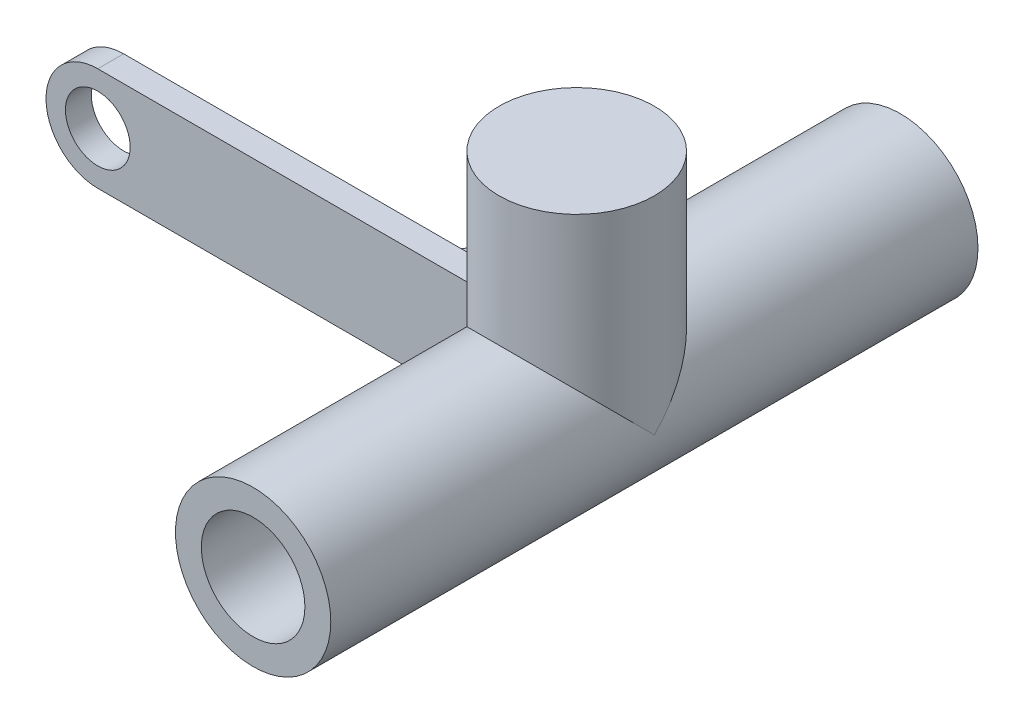
ISO-10303-21;
HEADER;
FILE_DESCRIPTION(('STEP AP214'),'2;1');
FILE_NAME('part.step','',(''),(''),'','','');
FILE_SCHEMA(('AUTOMOTIVE_DESIGN { 1 0 10303 214 1 1 1 1 }'));
ENDSEC;
DATA;
#1=APPLICATION_CONTEXT('core data for automotive mechanical design processes');
#2=APPLICATION_PROTOCOL_DEFINITION('international standard','automotive_design',2000,#1);
#3=PRODUCT_CONTEXT('',#1,'mechanical');
#4=PRODUCT('Part','Part','',(#3));
#5=PRODUCT_RELATED_PRODUCT_CATEGORY('part','',(#4));
#6=PRODUCT_DEFINITION_FORMATION('','',#4);
#7=PRODUCT_DEFINITION_CONTEXT('part definition',#1,'design');
#8=PRODUCT_DEFINITION('design','',#6,#7);
#9=PRODUCT_DEFINITION_SHAPE('','',#8);
#10=(LENGTH_UNIT() NAMED_UNIT(*) SI_UNIT(.MILLI.,.METRE.));
#11=(NAMED_UNIT(*) PLANE_ANGLE_UNIT() SI_UNIT($,.RADIAN.));
#12=(NAMED_UNIT(*) SI_UNIT($,.STERADIAN.) SOLID_ANGLE_UNIT());
#13=UNCERTAINTY_MEASURE_WITH_UNIT(LENGTH_MEASURE(1.E-05),#10,'distance_accuracy_value','');
#14=(GEOMETRIC_REPRESENTATION_CONTEXT(3) GLOBAL_UNCERTAINTY_ASSIGNED_CONTEXT((#13)) GLOBAL_UNIT_ASSIGNED_CONTEXT((#10,
#11,#12)) REPRESENTATION_CONTEXT('',''));
#15=CARTESIAN_POINT('',(0.,0.,0.));
#16=DIRECTION('',(0.,0.,1.));
#17=DIRECTION('',(1.,0.,0.));
#18=AXIS2_PLACEMENT_3D('',#15,#16,#17);
#19=CARTESIAN_POINT('',(0.,0.,125.));
#20=DIRECTION('',(0.,0.,-1.));
#21=DIRECTION('',(-1.,0.,0.));
#22=AXIS2_PLACEMENT_3D('',#19,#20,#21);
#23=CYLINDRICAL_SURFACE('',#22,15.);
#24=CARTESIAN_POINT('',(0.,0.,125.));
#25=DIRECTION('',(0.,0.,1.));
#26=DIRECTION('',(1.,0.,0.));
#27=AXIS2_PLACEMENT_3D('',#24,#25,#26);
#28=CIRCLE('',#27,15.);
#29=CARTESIAN_POINT('',(15.,0.,125.));
#30=VERTEX_POINT('',#29);
#31=EDGE_CURVE('E234',#30,#30,#28,.T.);
#32=ORIENTED_EDGE('',*,*,#31,.F.);
#33=EDGE_LOOP('',(#32));
#34=FACE_BOUND('',#33,.T.);
#35=CARTESIAN_POINT('',(0.,0.,0.));
#36=DIRECTION('',(0.,0.,1.));
#37=DIRECTION('',(1.,0.,0.));
#38=AXIS2_PLACEMENT_3D('',#35,#36,#37);
#39=CIRCLE('',#38,15.);
#40=CARTESIAN_POINT('',(15.,0.,0.));
#41=VERTEX_POINT('',#40);
#42=EDGE_CURVE('E231',#41,#41,#39,.T.);
#43=ORIENTED_EDGE('',*,*,#42,.T.);
#44=EDGE_LOOP('',(#43));
#45=FACE_BOUND('',#44,.T.);
#46=DIRECTION('',(0.,0.,-1.));
#47=VECTOR('',#46,1.);
#48=CARTESIAN_POINT('',(-14.9666295470958,-0.999999999999999,125.));
#49=LINE('',#48,#47);
#50=CARTESIAN_POINT('',(-14.9666295470958,-1.,30.));
#51=VERTEX_POINT('',#50);
#52=CARTESIAN_POINT('',(-14.9666295470958,-0.999999999999999,60.));
#53=VERTEX_POINT('',#52);
#54=EDGE_CURVE('E174',#51,#53,#49,.F.);
#55=ORIENTED_EDGE('',*,*,#54,.F.);
#56=CARTESIAN_POINT('',(0.,0.,30.));
#57=DIRECTION('',(0.,0.,-1.));
#58=DIRECTION('',(-1.,0.,0.));
#59=AXIS2_PLACEMENT_3D('',#56,#57,#58);
#60=CIRCLE('',#59,15.);
#61=CARTESIAN_POINT('',(-14.9666295470958,1.,30.));
#62=VERTEX_POINT('',#61);
#63=EDGE_CURVE('E11',#51,#62,#60,.T.);
#64=ORIENTED_EDGE('',*,*,#63,.T.);
#65=DIRECTION('',(0.,0.,-1.));
#66=VECTOR('',#65,1.);
#67=CARTESIAN_POINT('',(-14.9666295470958,1.,125.));
#68=LINE('',#67,#66);
#69=CARTESIAN_POINT('',(-14.9666295470958,1.,60.));
#70=VERTEX_POINT('',#69);
#71=EDGE_CURVE('E166',#70,#62,#68,.T.);
#72=ORIENTED_EDGE('',*,*,#71,.F.);
#73=CARTESIAN_POINT('',(0.,0.,60.));
#74=DIRECTION('',(0.,0.,-1.));
#75=DIRECTION('',(-1.,0.,0.));
#76=AXIS2_PLACEMENT_3D('',#73,#74,#75);
#77=CIRCLE('',#76,15.);
#78=CARTESIAN_POINT('',(-14.790199457749,2.5,60.));
#79=VERTEX_POINT('',#78);
#80=EDGE_CURVE('E172',#70,#79,#77,.T.);
#81=ORIENTED_EDGE('',*,*,#80,.T.);
#82=CARTESIAN_POINT('',(0.,0.,62.5));
#83=DIRECTION('',(0.,-0.707106781186547,-0.707106781186547));
#84=DIRECTION('',(0.,0.707106781186547,-0.707106781186547));
#85=AXIS2_PLACEMENT_3D('',#82,#83,#84);
#86=ELLIPSE('',#85,21.2132034355964,15.);
#87=CARTESIAN_POINT('',(15.,0.,62.5));
#88=VERTEX_POINT('',#87);
#89=EDGE_CURVE('E224',#88,#79,#86,.F.);
#90=ORIENTED_EDGE('',*,*,#89,.F.);
#91=CARTESIAN_POINT('',(0.,0.,62.5));
#92=DIRECTION('',(0.,0.707106781186547,-0.707106781186547));
#93=DIRECTION('',(0.,-0.707106781186547,-0.707106781186547));
#94=AXIS2_PLACEMENT_3D('',#91,#92,#93);
#95=ELLIPSE('',#94,21.2132034355964,15.);
#96=CARTESIAN_POINT('',(-14.790199457749,2.5,65.));
#97=VERTEX_POINT('',#96);
#98=EDGE_CURVE('E219',#97,#88,#95,.T.);
#99=ORIENTED_EDGE('',*,*,#98,.F.);
#100=CARTESIAN_POINT('',(0.,0.,65.));
#101=DIRECTION('',(0.,0.,1.));
#102=DIRECTION('',(1.,0.,0.));
#103=AXIS2_PLACEMENT_3D('',#100,#101,#102);
#104=CIRCLE('',#103,15.);
#105=CARTESIAN_POINT('',(-11.1803398874989,-10.,65.));
#106=VERTEX_POINT('',#105);
#107=EDGE_CURVE('E204',#97,#106,#104,.T.);
#108=ORIENTED_EDGE('',*,*,#107,.T.);
#109=DIRECTION('',(0.,0.,-1.));
#110=VECTOR('',#109,1.);
#111=CARTESIAN_POINT('',(-11.180339887499,-10.,125.));
#112=LINE('',#111,#110);
#113=CARTESIAN_POINT('',(-11.1803398874989,-10.,60.));
#114=VERTEX_POINT('',#113);
#115=EDGE_CURVE('E212',#106,#114,#112,.T.);
#116=ORIENTED_EDGE('',*,*,#115,.T.);
#117=EDGE_CURVE('E196',#114,#53,#77,.T.);
#118=ORIENTED_EDGE('',*,*,#117,.T.);
#119=EDGE_LOOP('',(#55,#64,#72,#81,#90,#99,#108,#116,#118));
#120=FACE_BOUND('',#119,.T.);
#121=ADVANCED_FACE('F43',(#34,#45,#120),#23,.T.);
#122=CARTESIAN_POINT('',(-100.,-10.,60.));
#123=DIRECTION('',(0.,0.,-1.));
#124=DIRECTION('',(-1.,0.,0.));
#125=AXIS2_PLACEMENT_3D('',#122,#123,#124);
#126=PLANE('',#125);
#127=CARTESIAN_POINT('',(-90.,0.,60.));
#128=DIRECTION('',(0.,0.,-1.));
#129=DIRECTION('',(-1.,0.,0.));
#130=AXIS2_PLACEMENT_3D('',#127,#128,#129);
#131=CIRCLE('',#130,6.25);
#132=CARTESIAN_POINT('',(-96.25,0.,60.));
#133=VERTEX_POINT('',#132);
#134=EDGE_CURVE('E402',#133,#133,#131,.T.);
#135=ORIENTED_EDGE('',*,*,#134,.F.);
#136=EDGE_LOOP('',(#135));
#137=FACE_BOUND('',#136,.T.);
#138=DIRECTION('',(1.,0.,0.));
#139=VECTOR('',#138,1.);
#140=CARTESIAN_POINT('',(-14.,1.,60.));
#141=LINE('',#140,#139);
#142=CARTESIAN_POINT('',(-42.03455484,1.,60.));
#143=VERTEX_POINT('',#142);
#144=EDGE_CURVE('E160',#143,#70,#141,.T.);
#145=ORIENTED_EDGE('',*,*,#144,.F.);
#146=DIRECTION('',(0.,1.,0.));
#147=VECTOR('',#146,1.);
#148=CARTESIAN_POINT('',(-42.03455484,1.,60.));
#149=LINE('',#148,#147);
#150=CARTESIAN_POINT('',(-42.03455484,-0.999999999999999,60.));
#151=VERTEX_POINT('',#150);
#152=EDGE_CURVE('E148',#151,#143,#149,.T.);
#153=ORIENTED_EDGE('',*,*,#152,.F.);
#154=DIRECTION('',(1.,0.,0.));
#155=VECTOR('',#154,1.);
#156=CARTESIAN_POINT('',(-100.,-0.999999999999999,60.));
#157=LINE('',#156,#155);
#158=EDGE_CURVE('E52',#151,#53,#157,.T.);
#159=ORIENTED_EDGE('',*,*,#158,.T.);
#160=ORIENTED_EDGE('',*,*,#117,.F.);
#161=DIRECTION('',(1.,0.,0.));
#162=VECTOR('',#161,1.);
#163=CARTESIAN_POINT('',(-100.,-10.,60.));
#164=LINE('',#163,#162);
#165=CARTESIAN_POINT('',(-90.,-10.,60.));
#166=VERTEX_POINT('',#165);
#167=EDGE_CURVE('E193',#166,#114,#164,.T.);
#168=ORIENTED_EDGE('',*,*,#167,.F.);
#169=CARTESIAN_POINT('',(-90.,0.,60.));
#170=DIRECTION('',(0.,0.,-1.));
#171=DIRECTION('',(-1.,0.,0.));
#172=AXIS2_PLACEMENT_3D('',#169,#170,#171);
#173=CIRCLE('',#172,10.);
#174=CARTESIAN_POINT('',(-100.,0.,60.));
#175=VERTEX_POINT('',#174);
#176=EDGE_CURVE('E343',#166,#175,#173,.T.);
#177=ORIENTED_EDGE('',*,*,#176,.T.);
#178=CARTESIAN_POINT('',(-90.,0.,60.));
#179=DIRECTION('',(0.,0.,-1.));
#180=DIRECTION('',(-1.,0.,0.));
#181=AXIS2_PLACEMENT_3D('',#178,#179,#180);
#182=CIRCLE('',#181,10.);
#183=CARTESIAN_POINT('',(-90.,10.,60.));
#184=VERTEX_POINT('',#183);
#185=EDGE_CURVE('E355',#175,#184,#182,.T.);
#186=ORIENTED_EDGE('',*,*,#185,.T.);
#187=DIRECTION('',(1.,0.,0.));
#188=VECTOR('',#187,1.);
#189=CARTESIAN_POINT('',(-100.,10.,60.));
#190=LINE('',#189,#188);
#191=CARTESIAN_POINT('',(-14.790199457749,10.,60.));
#192=VERTEX_POINT('',#191);
#193=EDGE_CURVE('E191',#184,#192,#190,.T.);
#194=ORIENTED_EDGE('',*,*,#193,.T.);
#195=DIRECTION('',(0.,-1.,0.));
#196=VECTOR('',#195,1.);
#197=CARTESIAN_POINT('',(-14.790199457749,40.,60.));
#198=LINE('',#197,#196);
#199=EDGE_CURVE('E368',#79,#192,#198,.F.);
#200=ORIENTED_EDGE('',*,*,#199,.F.);
#201=ORIENTED_EDGE('',*,*,#80,.F.);
#202=EDGE_LOOP('',(#145,#153,#159,#160,#168,#177,#186,#194,#200,#201));
#203=FACE_BOUND('',#202,.T.);
#204=ADVANCED_FACE('F170',(#137,#203),#126,.T.);
#205=CARTESIAN_POINT('',(0.,0.,125.));
#206=DIRECTION('',(0.,0.,-1.));
#207=DIRECTION('',(-1.,0.,0.));
#208=AXIS2_PLACEMENT_3D('',#205,#206,#207);
#209=CYLINDRICAL_SURFACE('',#208,10.);
#210=CARTESIAN_POINT('',(0.,0.,65.));
#211=DIRECTION('',(0.,0.,1.));
#212=DIRECTION('',(1.,0.,0.));
#213=AXIS2_PLACEMENT_3D('',#210,#211,#212);
#214=CIRCLE('',#213,10.);
#215=CARTESIAN_POINT('',(-10.,0.,65.));
#216=VERTEX_POINT('',#215);
#217=CARTESIAN_POINT('',(0.,-10.,65.));
#218=VERTEX_POINT('',#217);
#219=EDGE_CURVE('E210',#216,#218,#214,.T.);
#220=ORIENTED_EDGE('',*,*,#219,.F.);
#221=DIRECTION('',(0.,0.,-1.));
#222=VECTOR('',#221,1.);
#223=CARTESIAN_POINT('',(-10.,0.,125.));
#224=LINE('',#223,#222);
#225=CARTESIAN_POINT('',(-10.,0.,73.6803398874989));
#226=VERTEX_POINT('',#225);
#227=EDGE_CURVE('E237',#216,#226,#224,.F.);
#228=ORIENTED_EDGE('',*,*,#227,.T.);
#229=CARTESIAN_POINT('',(-10.,0.,73.6803398874989));
#230=CARTESIAN_POINT('',(-10.0000019662644,0.122908083291886,73.6803341285554));
#231=CARTESIAN_POINT('',(-9.99773339672962,0.245795438662537,73.682367652214));
#232=CARTESIAN_POINT('',(-9.98868075195431,0.491259157771999,73.6904562528802));
#233=CARTESIAN_POINT('',(-9.98189712810506,0.613835551369558,73.696510927874));
#234=CARTESIAN_POINT('',(-9.95484008556213,0.980341470499923,73.7205962021832));
#235=CARTESIAN_POINT('',(-9.92786031801124,1.22344075436707,73.7445484143372));
#236=CARTESIAN_POINT('',(-9.85692199140147,1.70271606910721,73.8067794801167));
#237=CARTESIAN_POINT('',(-9.81313360307206,1.93893674586964,73.8449146287484));
#238=CARTESIAN_POINT('',(-9.70933595979468,2.40539084014844,73.9338733583765));
#239=CARTESIAN_POINT('',(-9.64932198669643,2.63562249476913,73.9847006297178));
#240=CARTESIAN_POINT('',(-9.51430209888207,3.08762076307501,74.0967965567621));
#241=CARTESIAN_POINT('',(-9.43937638209315,3.30942540898784,74.1580091094161));
#242=CARTESIAN_POINT('',(-9.2752123820489,3.74494680876639,74.2890411827064));
#243=CARTESIAN_POINT('',(-9.18597482688439,3.95866397338595,74.3588602654582));
#244=CARTESIAN_POINT('',(-8.89735329466268,4.58807557587278,74.5787194524851));
#245=CARTESIAN_POINT('',(-8.67735629737759,4.9910554450501,74.7389043780611));
#246=CARTESIAN_POINT('',(-8.29129524792108,5.59675485228079,75.0013515100961));
#247=CARTESIAN_POINT('',(-8.14170204702141,5.81216410863114,75.0994998696131));
#248=CARTESIAN_POINT('',(-7.8264923183353,6.23012673255033,75.2976804602116));
#249=CARTESIAN_POINT('',(-7.66087472678607,6.43267924515728,75.3977128160049));
#250=CARTESIAN_POINT('',(-7.31418209262196,6.8243065835301,75.5974342938179));
#251=CARTESIAN_POINT('',(-7.13310489225783,7.01337952112642,75.6971233658976));
#252=CARTESIAN_POINT('',(-6.75590366095745,7.37743148512814,75.8941428962359));
#253=CARTESIAN_POINT('',(-6.55977230733853,7.55240356663882,75.9914721759597));
#254=CARTESIAN_POINT('',(-6.1235004030377,7.91162090637637,76.1955771283599));
#255=CARTESIAN_POINT('',(-5.88110397785952,8.09352620425258,76.3016735607452));
#256=CARTESIAN_POINT('',(-5.37841190890662,8.43594148342965,76.5052195059547));
#257=CARTESIAN_POINT('',(-5.11812584836926,8.59646278650464,76.6026735852692));
#258=CARTESIAN_POINT('',(-4.58092530474232,8.89434642230069,76.7862046380633));
#259=CARTESIAN_POINT('',(-4.30401783641956,9.03171843285677,76.8722863626223));
#260=CARTESIAN_POINT('',(-3.73529722016773,9.28137561061249,77.0304715239106));
#261=CARTESIAN_POINT('',(-3.44348728334321,9.39366615444473,77.1025779560387));
#262=CARTESIAN_POINT('',(-2.88082821284893,9.58011233592226,77.223250182534));
#263=CARTESIAN_POINT('',(-2.61129919972899,9.65713262962674,77.2735492311711));
#264=CARTESIAN_POINT('',(-2.0645294229625,9.78860280762324,77.3598209230397));
#265=CARTESIAN_POINT('',(-1.78728918107016,9.84305421501748,77.3957945330429));
#266=CARTESIAN_POINT('',(-1.22793917300902,9.92834932789231,77.4522941504247));
#267=CARTESIAN_POINT('',(-0.945834860668396,9.95921791293619,77.4728364372598));
#268=CARTESIAN_POINT('',(-0.379327505846203,9.99683241551685,77.4978816841611));
#269=CARTESIAN_POINT('',(-0.094924793379789,10.0035817366327,77.50238690729));
#270=CARTESIAN_POINT('',(0.42989033312902,9.99365946293529,77.4957738621773));
#271=CARTESIAN_POINT('',(0.670405430373816,9.98039843933322,77.4869306305415));
#272=CARTESIAN_POINT('',(1.14916934748079,9.93665826160711,77.4578376542313));
#273=CARTESIAN_POINT('',(1.38741821686984,9.90617948464865,77.4375881594182));
#274=CARTESIAN_POINT('',(1.8599416134959,9.82842601275427,77.3861382030705));
#275=CARTESIAN_POINT('',(2.09421618238098,9.78115149394085,77.3549378563681));
#276=CARTESIAN_POINT('',(2.55727839003123,9.67041909157562,77.2822617118014));
#277=CARTESIAN_POINT('',(2.78606579121633,9.60696050867491,77.2407854698954));
#278=CARTESIAN_POINT('',(3.23586004110859,9.46491433929526,77.1486073470994));
#279=CARTESIAN_POINT('',(3.45689579211392,9.38639210985778,77.0979453708846));
#280=CARTESIAN_POINT('',(3.89118343175868,9.21483719709088,76.9882323039131));
#281=CARTESIAN_POINT('',(4.1044327303078,9.1217997387039,76.9291784530634));
#282=CARTESIAN_POINT('',(4.52213359273533,8.9221009894455,76.8037704642793));
#283=CARTESIAN_POINT('',(4.72658750024244,8.81544335825792,76.7374182880364));
#284=CARTESIAN_POINT('',(5.12613026843351,8.58926728521921,76.5984944832681));
#285=CARTESIAN_POINT('',(5.32121574797326,8.46974424983818,76.5259206352203));
#286=CARTESIAN_POINT('',(5.72633078565189,8.20216646387367,76.3658779971488));
#287=CARTESIAN_POINT('',(5.93496872233939,8.05242530391318,76.2777035729189));
#288=CARTESIAN_POINT('',(6.33894603460613,7.73842700250566,76.0965729756602));
#289=CARTESIAN_POINT('',(6.53427941602822,7.57416339378907,76.0036146800134));
#290=CARTESIAN_POINT('',(6.91132960510199,7.23176778878176,75.8145806026908));
#291=CARTESIAN_POINT('',(7.09302687376191,7.05361661073946,75.7185006199906));
#292=CARTESIAN_POINT('',(7.44198959608793,6.68440712720149,75.5252280827419));
#293=CARTESIAN_POINT('',(7.60925973806327,6.49335305095354,75.4280359013365));
#294=CARTESIAN_POINT('',(7.95384735185595,6.06814596506086,75.2193915728319));
#295=CARTESIAN_POINT('',(8.12868447910812,5.83191005670115,75.1080713984021));
#296=CARTESIAN_POINT('',(8.45775206098623,5.34351489749032,74.8897309634299));
#297=CARTESIAN_POINT('',(8.61197769657104,5.09135194306177,74.7827117125346));
#298=CARTESIAN_POINT('',(8.89853128768456,4.57208818968848,74.5767233207897));
#299=CARTESIAN_POINT('',(9.03088152717082,4.30500296758524,74.4777460406991));
#300=CARTESIAN_POINT('',(9.27240645990512,3.75661281001168,74.2917648681875));
#301=CARTESIAN_POINT('',(9.38159284001154,3.47531513427529,74.2047549457079));
#302=CARTESIAN_POINT('',(9.54801158638536,2.9804793272992,74.0690778214802));
#303=CARTESIAN_POINT('',(9.61123177037526,2.770013403874,74.0164952118853));
#304=CARTESIAN_POINT('',(9.72408164930214,2.34326880833405,73.9213698799915));
#305=CARTESIAN_POINT('',(9.77371524585155,2.12699182459367,73.878824275887));
#306=CARTESIAN_POINT('',(9.85861049231009,1.69030911284007,73.8053505181962));
#307=CARTESIAN_POINT('',(9.89391085780338,1.46991621176618,73.7743910871009));
#308=CARTESIAN_POINT('',(9.94974461286417,1.02594789295992,73.7251497436318));
#309=CARTESIAN_POINT('',(9.97028723032151,0.802374553285027,73.7068599093269));
#310=CARTESIAN_POINT('',(9.98884716882532,0.481904573199954,73.6903071254827));
#311=CARTESIAN_POINT('',(9.99302852832223,0.385592968518363,73.6865722173172));
#312=CARTESIAN_POINT('',(9.99860456831422,0.192858527287807,73.6815883268953));
#313=CARTESIAN_POINT('',(10.0000002177439,0.0964357410905485,73.6803384802773));
#314=CARTESIAN_POINT('',(10.,0.,73.680339887499));
#315=B_SPLINE_CURVE_WITH_KNOTS('',3,(#229,#230,#231,#232,#233,#234,#235,#236,#237,#238,#239,
#240,#241,#242,#243,#244,#245,#246,#247,#248,#249,#250,#251,#252,#253,#254,#255,#256,#257,#258,
#259,#260,#261,#262,#263,#264,#265,#266,#267,#268,#269,#270,#271,#272,#273,#274,#275,#276,#277,
#278,#279,#280,#281,#282,#283,#284,#285,#286,#287,#288,#289,#290,#291,#292,#293,#294,#295,#296,
#297,#298,#299,#300,#301,#302,#303,#304,#305,#306,#307,#308,#309,#310,#311,#312,#313,#314),
.UNSPECIFIED.,.F.,.F.,(4,2,2,2,2,2,2,2,2,2,2,2,2,2,2,2,2,2,2,2,2,2,2,2,2,2,2,2,2,2,2,2,2,2,2,2,
2,2,2,2,2,2,4),(0.,0.368646050186405,0.737255250621695,1.47329974643748,2.20208108990007,
2.93107458010894,3.65624850314493,4.38138554586728,5.83478174144706,6.67426475194119,
7.513803528942,8.35345967533994,9.19352686995974,10.1555208892916,11.1170035384646,
12.078083225863,13.0389566915795,13.8920552544147,14.745096234968,15.5972360211362,
16.4492555532334,17.1715077978443,17.8937442216846,18.6159730722762,19.3382331372499,
20.0574276279281,20.7768592119827,21.4960978929086,22.2155942317108,23.0293731080495,
23.8435162270739,24.658804488051,25.4738268028542,26.4155476148543,27.3574882208219,
28.2984632997486,29.2389624936457,29.9162147428955,30.5932723034906,31.2684886948951,
31.9432825110777,32.2326465857274,32.5219099952884),.UNSPECIFIED.);
#316=CARTESIAN_POINT('',(10.,0.,73.6803398874989));
#317=VERTEX_POINT('',#316);
#318=EDGE_CURVE('E243',#226,#317,#315,.T.);
#319=ORIENTED_EDGE('',*,*,#318,.T.);
#320=DIRECTION('',(0.,0.,-1.));
#321=VECTOR('',#320,1.);
#322=CARTESIAN_POINT('',(10.,0.,125.));
#323=LINE('',#322,#321);
#324=CARTESIAN_POINT('',(10.,0.,51.319660112501));
#325=VERTEX_POINT('',#324);
#326=EDGE_CURVE('E370',#317,#325,#323,.T.);
#327=ORIENTED_EDGE('',*,*,#326,.T.);
#328=CARTESIAN_POINT('',(10.,0.,51.319660112501));
#329=CARTESIAN_POINT('',(10.0000019662644,0.122908083291886,51.3196658714446));
#330=CARTESIAN_POINT('',(9.99773339672962,0.245795438662537,51.317632347786));
#331=CARTESIAN_POINT('',(9.98868075195431,0.491259157771998,51.3095437471198));
#332=CARTESIAN_POINT('',(9.98189712810506,0.613835551369558,51.303489072126));
#333=CARTESIAN_POINT('',(9.95484008556213,0.980341470499924,51.2794037978168));
#334=CARTESIAN_POINT('',(9.92786031801123,1.22344075436707,51.2554515856628));
#335=CARTESIAN_POINT('',(9.85692199140147,1.70271606910721,51.1932205198833));
#336=CARTESIAN_POINT('',(9.81313360307206,1.93893674586964,51.1550853712516));
#337=CARTESIAN_POINT('',(9.70933595979468,2.40539084014844,51.0661266416235));
#338=CARTESIAN_POINT('',(9.64932198669643,2.63562249476913,51.0152993702821));
#339=CARTESIAN_POINT('',(9.51430209888207,3.08762076307501,50.9032034432378));
#340=CARTESIAN_POINT('',(9.43937638209315,3.30942540898784,50.8419908905839));
#341=CARTESIAN_POINT('',(9.2752123820489,3.7449468087664,50.7109588172936));
#342=CARTESIAN_POINT('',(9.18597482688439,3.95866397338596,50.6411397345418));
#343=CARTESIAN_POINT('',(8.89735329466268,4.58807557587278,50.4212805475149));
#344=CARTESIAN_POINT('',(8.67735629737758,4.9910554450501,50.2610956219389));
#345=CARTESIAN_POINT('',(8.29129524792107,5.5967548522808,49.9986484899039));
#346=CARTESIAN_POINT('',(8.1417020470214,5.81216410863114,49.9005001303869));
#347=CARTESIAN_POINT('',(7.82649231833529,6.23012673255034,49.7023195397884));
#348=CARTESIAN_POINT('',(7.66087472678606,6.43267924515728,49.6022871839951));
#349=CARTESIAN_POINT('',(7.31418209262196,6.82430658353011,49.4025657061821));
#350=CARTESIAN_POINT('',(7.13310489225783,7.01337952112643,49.3028766341024));
#351=CARTESIAN_POINT('',(6.75590366095745,7.37743148512814,49.1058571037641));
#352=CARTESIAN_POINT('',(6.55977230733853,7.55240356663883,49.0085278240403));
#353=CARTESIAN_POINT('',(6.12350040303769,7.91162090637637,48.8044228716401));
#354=CARTESIAN_POINT('',(5.88110397785951,8.09352620425258,48.6983264392548));
#355=CARTESIAN_POINT('',(5.37841190890662,8.43594148342965,48.4947804940453));
#356=CARTESIAN_POINT('',(5.11812584836926,8.59646278650464,48.3973264147308));
#357=CARTESIAN_POINT('',(4.58092530474232,8.89434642230069,48.2137953619367));
#358=CARTESIAN_POINT('',(4.30401783641956,9.03171843285677,48.1277136373777));
#359=CARTESIAN_POINT('',(3.73529722016773,9.28137561061249,47.9695284760894));
#360=CARTESIAN_POINT('',(3.44348728334321,9.39366615444473,47.8974220439613));
#361=CARTESIAN_POINT('',(2.88082821284893,9.58011233592226,47.776749817466));
#362=CARTESIAN_POINT('',(2.61129919972898,9.65713262962674,47.7264507688289));
#363=CARTESIAN_POINT('',(2.0645294229625,9.78860280762324,47.6401790769603));
#364=CARTESIAN_POINT('',(1.78728918107017,9.84305421501748,47.6042054669571));
#365=CARTESIAN_POINT('',(1.22793917300902,9.92834932789231,47.5477058495753));
#366=CARTESIAN_POINT('',(0.945834860668397,9.95921791293619,47.5271635627402));
#367=CARTESIAN_POINT('',(0.379327505846205,9.99683241551685,47.5021183158389));
#368=CARTESIAN_POINT('',(0.0949247933797915,10.0035817366327,47.49761309271));
#369=CARTESIAN_POINT('',(-0.429890333129018,9.99365946293529,47.5042261378227));
#370=CARTESIAN_POINT('',(-0.670405430373816,9.98039843933322,47.5130693694585));
#371=CARTESIAN_POINT('',(-1.14916934748079,9.93665826160711,47.5421623457687));
#372=CARTESIAN_POINT('',(-1.38741821686984,9.90617948464865,47.5624118405818));
#373=CARTESIAN_POINT('',(-1.8599416134959,9.82842601275427,47.6138617969295));
#374=CARTESIAN_POINT('',(-2.09421618238097,9.78115149394085,47.6450621436319));
#375=CARTESIAN_POINT('',(-2.55727839003123,9.67041909157562,47.7177382881986));
#376=CARTESIAN_POINT('',(-2.78606579121632,9.60696050867492,47.7592145301046));
#377=CARTESIAN_POINT('',(-3.23586004110859,9.46491433929526,47.8513926529006));
#378=CARTESIAN_POINT('',(-3.45689579211392,9.38639210985778,47.9020546291154));
#379=CARTESIAN_POINT('',(-3.89118343175868,9.21483719709088,48.0117676960869));
#380=CARTESIAN_POINT('',(-4.10443273030779,9.1217997387039,48.0708215469366));
#381=CARTESIAN_POINT('',(-4.52213359273533,8.9221009894455,48.1962295357207));
#382=CARTESIAN_POINT('',(-4.72658750024245,8.81544335825792,48.2625817119636));
#383=CARTESIAN_POINT('',(-5.12613026843352,8.58926728521921,48.401505516732));
#384=CARTESIAN_POINT('',(-5.32121574797326,8.46974424983818,48.4740793647797));
#385=CARTESIAN_POINT('',(-5.72633078565189,8.20216646387367,48.6341220028512));
#386=CARTESIAN_POINT('',(-5.93496872233939,8.05242530391318,48.7222964270811));
#387=CARTESIAN_POINT('',(-6.33894603460613,7.73842700250566,48.9034270243398));
#388=CARTESIAN_POINT('',(-6.53427941602822,7.57416339378907,48.9963853199866));
#389=CARTESIAN_POINT('',(-6.91132960510199,7.23176778878176,49.1854193973092));
#390=CARTESIAN_POINT('',(-7.09302687376191,7.05361661073946,49.2814993800094));
#391=CARTESIAN_POINT('',(-7.44198959608793,6.68440712720149,49.4747719172581));
#392=CARTESIAN_POINT('',(-7.60925973806327,6.49335305095354,49.5719640986635));
#393=CARTESIAN_POINT('',(-7.95384735185595,6.06814596506086,49.7806084271681));
#394=CARTESIAN_POINT('',(-8.12868447910812,5.83191005670115,49.8919286015979));
#395=CARTESIAN_POINT('',(-8.45775206098623,5.34351489749032,50.1102690365701));
#396=CARTESIAN_POINT('',(-8.61197769657104,5.09135194306177,50.2172882874654));
#397=CARTESIAN_POINT('',(-8.89853128768456,4.57208818968848,50.4232766792104));
#398=CARTESIAN_POINT('',(-9.03088152717082,4.30500296758524,50.5222539593009));
#399=CARTESIAN_POINT('',(-9.27240645990512,3.75661281001168,50.7082351318125));
#400=CARTESIAN_POINT('',(-9.38159284001154,3.47531513427529,50.7952450542921));
#401=CARTESIAN_POINT('',(-9.54801158638536,2.9804793272992,50.9309221785198));
#402=CARTESIAN_POINT('',(-9.61123177037526,2.770013403874,50.9835047881147));
#403=CARTESIAN_POINT('',(-9.72408164930214,2.34326880833405,51.0786301200086));
#404=CARTESIAN_POINT('',(-9.77371524585155,2.12699182459367,51.121175724113));
#405=CARTESIAN_POINT('',(-9.85861049231009,1.69030911284007,51.1946494818038));
#406=CARTESIAN_POINT('',(-9.89391085780338,1.46991621176618,51.2256089128991));
#407=CARTESIAN_POINT('',(-9.94974461286417,1.02594789295992,51.2748502563682));
#408=CARTESIAN_POINT('',(-9.97028723032151,0.802374553285026,51.2931400906731));
#409=CARTESIAN_POINT('',(-9.98884716882532,0.481904573199953,51.3096928745173));
#410=CARTESIAN_POINT('',(-9.99302852832223,0.385592968518362,51.3134277826828));
#411=CARTESIAN_POINT('',(-9.99860456831422,0.192858527287807,51.3184116731047));
#412=CARTESIAN_POINT('',(-10.0000002177439,0.0964357410905482,51.3196615197227));
#413=CARTESIAN_POINT('',(-10.,0.,51.3196601125011));
#414=B_SPLINE_CURVE_WITH_KNOTS('',3,(#328,#329,#330,#331,#332,#333,#334,#335,#336,#337,#338,
#339,#340,#341,#342,#343,#344,#345,#346,#347,#348,#349,#350,#351,#352,#353,#354,#355,#356,#357,
#358,#359,#360,#361,#362,#363,#364,#365,#366,#367,#368,#369,#370,#371,#372,#373,#374,#375,#376,
#377,#378,#379,#380,#381,#382,#383,#384,#385,#386,#387,#388,#389,#390,#391,#392,#393,#394,#395,
#396,#397,#398,#399,#400,#401,#402,#403,#404,#405,#406,#407,#408,#409,#410,#411,#412,#413),
.UNSPECIFIED.,.F.,.F.,(4,2,2,2,2,2,2,2,2,2,2,2,2,2,2,2,2,2,2,2,2,2,2,2,2,2,2,2,2,2,2,2,2,2,2,2,
2,2,2,2,2,2,4),(0.,0.368646050186405,0.737255250621695,1.47329974643748,2.20208108990007,
2.93107458010894,3.65624850314493,4.38138554586729,5.83478174144707,6.6742647519412,
7.51380352894201,8.35345967533995,9.19352686995974,10.1555208892916,11.1170035384646,
12.078083225863,13.0389566915795,13.8920552544147,14.745096234968,15.5972360211362,
16.4492555532334,17.1715077978443,17.8937442216846,18.6159730722762,19.3382331372499,
20.0574276279281,20.7768592119827,21.4960978929086,22.2155942317108,23.0293731080495,
23.8435162270739,24.658804488051,25.4738268028542,26.4155476148543,27.3574882208219,
28.2984632997486,29.2389624936457,29.9162147428955,30.5932723034906,31.2684886948951,
31.9432825110777,32.2326465857274,32.5219099952884),.UNSPECIFIED.);
#415=CARTESIAN_POINT('',(-10.,0.,51.3196601125011));
#416=VERTEX_POINT('',#415);
#417=EDGE_CURVE('E252',#325,#416,#414,.T.);
#418=ORIENTED_EDGE('',*,*,#417,.T.);
#419=CARTESIAN_POINT('',(-10.,0.,60.));
#420=VERTEX_POINT('',#419);
#421=EDGE_CURVE('E240',#416,#420,#224,.F.);
#422=ORIENTED_EDGE('',*,*,#421,.T.);
#423=CARTESIAN_POINT('',(0.,0.,60.));
#424=DIRECTION('',(0.,0.,-1.));
#425=DIRECTION('',(-1.,0.,0.));
#426=AXIS2_PLACEMENT_3D('',#423,#424,#425);
#427=CIRCLE('',#426,10.);
#428=CARTESIAN_POINT('',(0.,-10.,60.));
#429=VERTEX_POINT('',#428);
#430=EDGE_CURVE('E202',#429,#420,#427,.T.);
#431=ORIENTED_EDGE('',*,*,#430,.F.);
#432=DIRECTION('',(0.,0.,-1.));
#433=VECTOR('',#432,1.);
#434=CARTESIAN_POINT('',(0.,-10.,65.));
#435=LINE('',#434,#433);
#436=EDGE_CURVE('E183',#218,#429,#435,.T.);
#437=ORIENTED_EDGE('',*,*,#436,.F.);
#438=EDGE_LOOP('',(#220,#228,#319,#327,#418,#422,#431,#437));
#439=FACE_BOUND('',#438,.T.);
#440=CARTESIAN_POINT('',(0.,0.,125.));
#441=DIRECTION('',(0.,0.,1.));
#442=DIRECTION('',(1.,0.,0.));
#443=AXIS2_PLACEMENT_3D('',#440,#441,#442);
#444=CIRCLE('',#443,10.);
#445=CARTESIAN_POINT('',(10.,0.,125.));
#446=VERTEX_POINT('',#445);
#447=EDGE_CURVE('E228',#446,#446,#444,.T.);
#448=ORIENTED_EDGE('',*,*,#447,.T.);
#449=EDGE_LOOP('',(#448));
#450=FACE_BOUND('',#449,.T.);
#451=CARTESIAN_POINT('',(0.,0.,0.));
#452=DIRECTION('',(0.,0.,1.));
#453=DIRECTION('',(1.,0.,0.));
#454=AXIS2_PLACEMENT_3D('',#451,#452,#453);
#455=CIRCLE('',#454,10.);
#456=CARTESIAN_POINT('',(10.,0.,0.));
#457=VERTEX_POINT('',#456);
#458=EDGE_CURVE('E227',#457,#457,#455,.T.);
#459=ORIENTED_EDGE('',*,*,#458,.F.);
#460=EDGE_LOOP('',(#459));
#461=FACE_BOUND('',#460,.T.);
#462=ADVANCED_FACE('F258',(#439,#450,#461),#209,.F.);
#463=CARTESIAN_POINT('',(0.,0.,125.));
#464=DIRECTION('',(0.,0.,1.));
#465=DIRECTION('',(1.,0.,0.));
#466=AXIS2_PLACEMENT_3D('',#463,#464,#465);
#467=PLANE('',#466);
#468=ORIENTED_EDGE('',*,*,#31,.T.);
#469=EDGE_LOOP('',(#468));
#470=FACE_BOUND('',#469,.T.);
#471=ORIENTED_EDGE('',*,*,#447,.F.);
#472=EDGE_LOOP('',(#471));
#473=FACE_BOUND('',#472,.T.);
#474=ADVANCED_FACE('F490',(#470,#473),#467,.T.);
#475=CARTESIAN_POINT('',(0.,0.,0.));
#476=DIRECTION('',(0.,0.,1.));
#477=DIRECTION('',(1.,0.,0.));
#478=AXIS2_PLACEMENT_3D('',#475,#476,#477);
#479=PLANE('',#478);
#480=ORIENTED_EDGE('',*,*,#42,.F.);
#481=EDGE_LOOP('',(#480));
#482=FACE_BOUND('',#481,.T.);
#483=ORIENTED_EDGE('',*,*,#458,.T.);
#484=EDGE_LOOP('',(#483));
#485=FACE_BOUND('',#484,.T.);
#486=ADVANCED_FACE('F272',(#482,#485),#479,.F.);
#487=CARTESIAN_POINT('',(0.,0.,62.5));
#488=DIRECTION('',(0.,1.,0.));
#489=DIRECTION('',(0.,0.,1.));
#490=AXIS2_PLACEMENT_3D('',#487,#488,#489);
#491=PLANE('',#490);
#492=ORIENTED_EDGE('',*,*,#227,.F.);
#493=DIRECTION('',(1.,0.,0.));
#494=VECTOR('',#493,1.);
#495=CARTESIAN_POINT('',(0.,0.,65.));
#496=LINE('',#495,#494);
#497=CARTESIAN_POINT('',(0.,0.,65.));
#498=VERTEX_POINT('',#497);
#499=EDGE_CURVE('E207',#216,#498,#496,.T.);
#500=ORIENTED_EDGE('',*,*,#499,.T.);
#501=DIRECTION('',(0.,0.,-1.));
#502=VECTOR('',#501,1.);
#503=CARTESIAN_POINT('',(0.,0.,62.5));
#504=LINE('',#503,#502);
#505=CARTESIAN_POINT('',(0.,0.,60.));
#506=VERTEX_POINT('',#505);
#507=EDGE_CURVE('E357',#498,#506,#504,.T.);
#508=ORIENTED_EDGE('',*,*,#507,.T.);
#509=DIRECTION('',(-1.,0.,0.));
#510=VECTOR('',#509,1.);
#511=CARTESIAN_POINT('',(0.,0.,60.));
#512=LINE('',#511,#510);
#513=EDGE_CURVE('E199',#506,#420,#512,.T.);
#514=ORIENTED_EDGE('',*,*,#513,.T.);
#515=ORIENTED_EDGE('',*,*,#421,.F.);
#516=CARTESIAN_POINT('',(0.,0.,62.5));
#517=DIRECTION('',(0.,1.,0.));
#518=DIRECTION('',(0.,0.,1.));
#519=AXIS2_PLACEMENT_3D('',#516,#517,#518);
#520=CIRCLE('',#519,15.);
#521=EDGE_CURVE('E220',#325,#416,#520,.T.);
#522=ORIENTED_EDGE('',*,*,#521,.F.);
#523=ORIENTED_EDGE('',*,*,#326,.F.);
#524=EDGE_CURVE('E215',#226,#317,#520,.T.);
#525=ORIENTED_EDGE('',*,*,#524,.F.);
#526=EDGE_LOOP('',(#492,#500,#508,#514,#515,#522,#523,#525));
#527=FACE_BOUND('',#526,.T.);
#528=ADVANCED_FACE('F266',(#527),#491,.F.);
#529=CARTESIAN_POINT('',(0.,40.,62.5));
#530=DIRECTION('',(0.,-1.,0.));
#531=DIRECTION('',(0.,0.,-1.));
#532=AXIS2_PLACEMENT_3D('',#529,#530,#531);
#533=CYLINDRICAL_SURFACE('',#532,15.);
#534=ORIENTED_EDGE('',*,*,#318,.F.);
#535=ORIENTED_EDGE('',*,*,#524,.T.);
#536=EDGE_LOOP('',(#534,#535));
#537=FACE_BOUND('',#536,.T.);
#538=ADVANCED_FACE('F261',(#537),#533,.T.);
#539=ORIENTED_EDGE('',*,*,#417,.F.);
#540=ORIENTED_EDGE('',*,*,#521,.T.);
#541=EDGE_LOOP('',(#539,#540));
#542=FACE_BOUND('',#541,.T.);
#543=ADVANCED_FACE('F265',(#542),#533,.T.);
#544=CARTESIAN_POINT('',(0.,40.,62.5));
#545=DIRECTION('',(0.,1.,0.));
#546=DIRECTION('',(0.,0.,1.));
#547=AXIS2_PLACEMENT_3D('',#544,#545,#546);
#548=CIRCLE('',#547,15.);
#549=CARTESIAN_POINT('',(0.,40.,77.5));
#550=VERTEX_POINT('',#549);
#551=EDGE_CURVE('E216',#550,#550,#548,.T.);
#552=ORIENTED_EDGE('',*,*,#551,.F.);
#553=EDGE_LOOP('',(#552));
#554=FACE_BOUND('',#553,.T.);
#555=CARTESIAN_POINT('',(0.,10.,62.5));
#556=DIRECTION('',(0.,1.,0.));
#557=DIRECTION('',(0.,0.,1.));
#558=AXIS2_PLACEMENT_3D('',#555,#556,#557);
#559=CIRCLE('',#558,15.);
#560=CARTESIAN_POINT('',(-14.790199457749,10.,65.));
#561=VERTEX_POINT('',#560);
#562=EDGE_CURVE('E365',#192,#561,#559,.T.);
#563=ORIENTED_EDGE('',*,*,#562,.T.);
#564=DIRECTION('',(0.,-1.,0.));
#565=VECTOR('',#564,1.);
#566=CARTESIAN_POINT('',(-14.790199457749,40.,65.));
#567=LINE('',#566,#565);
#568=EDGE_CURVE('E362',#561,#97,#567,.T.);
#569=ORIENTED_EDGE('',*,*,#568,.T.);
#570=ORIENTED_EDGE('',*,*,#98,.T.);
#571=ORIENTED_EDGE('',*,*,#89,.T.);
#572=ORIENTED_EDGE('',*,*,#199,.T.);
#573=EDGE_LOOP('',(#563,#569,#570,#571,#572));
#574=FACE_BOUND('',#573,.T.);
#575=ADVANCED_FACE('F268',(#554,#574),#533,.T.);
#576=CARTESIAN_POINT('',(0.,40.,62.5));
#577=DIRECTION('',(0.,1.,0.));
#578=DIRECTION('',(0.,0.,1.));
#579=AXIS2_PLACEMENT_3D('',#576,#577,#578);
#580=PLANE('',#579);
#581=ORIENTED_EDGE('',*,*,#551,.T.);
#582=EDGE_LOOP('',(#581));
#583=FACE_BOUND('',#582,.T.);
#584=ADVANCED_FACE('F274',(#583),#580,.T.);
#585=CARTESIAN_POINT('',(-100.,10.,65.));
#586=DIRECTION('',(0.,1.,0.));
#587=DIRECTION('',(0.,0.,1.));
#588=AXIS2_PLACEMENT_3D('',#585,#586,#587);
#589=PLANE('',#588);
#590=ORIENTED_EDGE('',*,*,#193,.F.);
#591=DIRECTION('',(0.,0.,1.));
#592=VECTOR('',#591,1.);
#593=CARTESIAN_POINT('',(-90.,10.,65.));
#594=LINE('',#593,#592);
#595=CARTESIAN_POINT('',(-90.,10.,65.));
#596=VERTEX_POINT('',#595);
#597=EDGE_CURVE('E67',#184,#596,#594,.T.);
#598=ORIENTED_EDGE('',*,*,#597,.T.);
#599=DIRECTION('',(1.,0.,0.));
#600=VECTOR('',#599,1.);
#601=CARTESIAN_POINT('',(-100.,10.,65.));
#602=LINE('',#601,#600);
#603=EDGE_CURVE('E189',#596,#561,#602,.T.);
#604=ORIENTED_EDGE('',*,*,#603,.T.);
#605=ORIENTED_EDGE('',*,*,#562,.F.);
#606=EDGE_LOOP('',(#590,#598,#604,#605));
#607=FACE_BOUND('',#606,.T.);
#608=ADVANCED_FACE('F277',(#607),#589,.T.);
#609=CARTESIAN_POINT('',(-100.,10.,65.));
#610=DIRECTION('',(0.,0.,1.));
#611=DIRECTION('',(1.,0.,0.));
#612=AXIS2_PLACEMENT_3D('',#609,#610,#611);
#613=PLANE('',#612);
#614=CARTESIAN_POINT('',(-90.,0.,65.));
#615=DIRECTION('',(0.,0.,1.));
#616=DIRECTION('',(1.,0.,0.));
#617=AXIS2_PLACEMENT_3D('',#614,#615,#616);
#618=CIRCLE('',#617,6.25);
#619=CARTESIAN_POINT('',(-83.75,0.,65.));
#620=VERTEX_POINT('',#619);
#621=EDGE_CURVE('E47',#620,#620,#618,.T.);
#622=ORIENTED_EDGE('',*,*,#621,.F.);
#623=EDGE_LOOP('',(#622));
#624=FACE_BOUND('',#623,.T.);
#625=CARTESIAN_POINT('',(-90.,0.,65.));
#626=DIRECTION('',(0.,0.,1.));
#627=DIRECTION('',(1.,0.,0.));
#628=AXIS2_PLACEMENT_3D('',#625,#626,#627);
#629=CIRCLE('',#628,10.);
#630=CARTESIAN_POINT('',(-100.,0.,65.));
#631=VERTEX_POINT('',#630);
#632=EDGE_CURVE('E59',#596,#631,#629,.T.);
#633=ORIENTED_EDGE('',*,*,#632,.T.);
#634=CARTESIAN_POINT('',(-90.,0.,65.));
#635=DIRECTION('',(0.,0.,1.));
#636=DIRECTION('',(1.,0.,0.));
#637=AXIS2_PLACEMENT_3D('',#634,#635,#636);
#638=CIRCLE('',#637,10.);
#639=CARTESIAN_POINT('',(-90.,-10.,65.));
#640=VERTEX_POINT('',#639);
#641=EDGE_CURVE('E337',#631,#640,#638,.T.);
#642=ORIENTED_EDGE('',*,*,#641,.T.);
#643=DIRECTION('',(1.,0.,0.));
#644=VECTOR('',#643,1.);
#645=CARTESIAN_POINT('',(-100.,-10.,65.));
#646=LINE('',#645,#644);
#647=EDGE_CURVE('E188',#640,#106,#646,.T.);
#648=ORIENTED_EDGE('',*,*,#647,.T.);
#649=ORIENTED_EDGE('',*,*,#107,.F.);
#650=ORIENTED_EDGE('',*,*,#568,.F.);
#651=ORIENTED_EDGE('',*,*,#603,.F.);
#652=EDGE_LOOP('',(#633,#642,#648,#649,#650,#651));
#653=FACE_BOUND('',#652,.T.);
#654=ADVANCED_FACE('F285',(#624,#653),#613,.T.);
#655=CARTESIAN_POINT('',(-100.,-10.,65.));
#656=DIRECTION('',(0.,-1.,0.));
#657=DIRECTION('',(0.,0.,-1.));
#658=AXIS2_PLACEMENT_3D('',#655,#656,#657);
#659=PLANE('',#658);
#660=ORIENTED_EDGE('',*,*,#647,.F.);
#661=DIRECTION('',(0.,0.,-1.));
#662=VECTOR('',#661,1.);
#663=CARTESIAN_POINT('',(-90.,-10.,60.));
#664=LINE('',#663,#662);
#665=EDGE_CURVE('E339',#640,#166,#664,.T.);
#666=ORIENTED_EDGE('',*,*,#665,.T.);
#667=ORIENTED_EDGE('',*,*,#167,.T.);
#668=ORIENTED_EDGE('',*,*,#115,.F.);
#669=EDGE_LOOP('',(#660,#666,#667,#668));
#670=FACE_BOUND('',#669,.T.);
#671=ADVANCED_FACE('F286',(#670),#659,.T.);
#672=CARTESIAN_POINT('',(0.,0.,0.));
#673=DIRECTION('',(1.,0.,0.));
#674=DIRECTION('',(0.,0.,-1.));
#675=AXIS2_PLACEMENT_3D('',#672,#673,#674);
#676=PLANE('',#675);
#677=ORIENTED_EDGE('',*,*,#507,.F.);
#678=DIRECTION('',(0.,-1.,0.));
#679=VECTOR('',#678,1.);
#680=CARTESIAN_POINT('',(0.,10.,65.));
#681=LINE('',#680,#679);
#682=EDGE_CURVE('E180',#498,#218,#681,.T.);
#683=ORIENTED_EDGE('',*,*,#682,.T.);
#684=ORIENTED_EDGE('',*,*,#436,.T.);
#685=DIRECTION('',(0.,1.,0.));
#686=VECTOR('',#685,1.);
#687=CARTESIAN_POINT('',(0.,-10.,60.));
#688=LINE('',#687,#686);
#689=EDGE_CURVE('E186',#429,#506,#688,.T.);
#690=ORIENTED_EDGE('',*,*,#689,.T.);
#691=EDGE_LOOP('',(#677,#683,#684,#690));
#692=FACE_BOUND('',#691,.T.);
#693=ADVANCED_FACE('F283',(#692),#676,.T.);
#694=ORIENTED_EDGE('',*,*,#499,.F.);
#695=ORIENTED_EDGE('',*,*,#219,.T.);
#696=ORIENTED_EDGE('',*,*,#682,.F.);
#697=EDGE_LOOP('',(#694,#695,#696));
#698=FACE_BOUND('',#697,.T.);
#699=ADVANCED_FACE('F279',(#698),#613,.T.);
#700=ORIENTED_EDGE('',*,*,#689,.F.);
#701=ORIENTED_EDGE('',*,*,#430,.T.);
#702=ORIENTED_EDGE('',*,*,#513,.F.);
#703=EDGE_LOOP('',(#700,#701,#702));
#704=FACE_BOUND('',#703,.T.);
#705=ADVANCED_FACE('F282',(#704),#126,.T.);
#706=CARTESIAN_POINT('',(-90.,0.,65.));
#707=DIRECTION('',(0.,0.,-1.));
#708=DIRECTION('',(-1.,0.,0.));
#709=AXIS2_PLACEMENT_3D('',#706,#707,#708);
#710=CYLINDRICAL_SURFACE('',#709,10.);
#711=DIRECTION('',(0.,0.,1.));
#712=VECTOR('',#711,1.);
#713=CARTESIAN_POINT('',(-100.,0.,60.));
#714=LINE('',#713,#712);
#715=EDGE_CURVE('E179',#631,#175,#714,.F.);
#716=ORIENTED_EDGE('',*,*,#715,.F.);
#717=ORIENTED_EDGE('',*,*,#632,.F.);
#718=ORIENTED_EDGE('',*,*,#597,.F.);
#719=ORIENTED_EDGE('',*,*,#185,.F.);
#720=EDGE_LOOP('',(#716,#717,#718,#719));
#721=FACE_BOUND('',#720,.T.);
#722=ADVANCED_FACE('F45',(#721),#710,.T.);
#723=CARTESIAN_POINT('',(-90.,0.,65.));
#724=DIRECTION('',(0.,0.,1.));
#725=DIRECTION('',(1.,0.,0.));
#726=AXIS2_PLACEMENT_3D('',#723,#724,#725);
#727=CYLINDRICAL_SURFACE('',#726,10.);
#728=ORIENTED_EDGE('',*,*,#641,.F.);
#729=ORIENTED_EDGE('',*,*,#715,.T.);
#730=ORIENTED_EDGE('',*,*,#176,.F.);
#731=ORIENTED_EDGE('',*,*,#665,.F.);
#732=EDGE_LOOP('',(#728,#729,#730,#731));
#733=FACE_BOUND('',#732,.T.);
#734=ADVANCED_FACE('F301',(#733),#727,.T.);
#735=CARTESIAN_POINT('',(-14.,-0.999999999999999,30.));
#736=DIRECTION('',(0.,1.,0.));
#737=DIRECTION('',(0.,0.,1.));
#738=AXIS2_PLACEMENT_3D('',#735,#736,#737);
#739=PLANE('',#738);
#740=ORIENTED_EDGE('',*,*,#158,.F.);
#741=DIRECTION('',(0.669892969166521,0.,-0.742457682202335));
#742=VECTOR('',#741,1.);
#743=CARTESIAN_POINT('',(-14.5328481676137,-0.999999999999999,29.5192301868857));
#744=LINE('',#743,#742);
#745=EDGE_CURVE('E155',#151,#51,#744,.T.);
#746=ORIENTED_EDGE('',*,*,#745,.T.);
#747=ORIENTED_EDGE('',*,*,#54,.T.);
#748=EDGE_LOOP('',(#740,#746,#747));
#749=FACE_BOUND('',#748,.T.);
#750=ADVANCED_FACE('F298',(#749),#739,.F.);
#751=CARTESIAN_POINT('',(-14.,1.,30.));
#752=DIRECTION('',(0.,-1.,0.));
#753=DIRECTION('',(0.,0.,-1.));
#754=AXIS2_PLACEMENT_3D('',#751,#752,#753);
#755=PLANE('',#754);
#756=ORIENTED_EDGE('',*,*,#71,.T.);
#757=DIRECTION('',(-0.669892969166521,0.,0.742457682202335));
#758=VECTOR('',#757,1.);
#759=CARTESIAN_POINT('',(-14.5328481676137,1.,29.5192301868857));
#760=LINE('',#759,#758);
#761=EDGE_CURVE('E152',#62,#143,#760,.T.);
#762=ORIENTED_EDGE('',*,*,#761,.T.);
#763=ORIENTED_EDGE('',*,*,#144,.T.);
#764=EDGE_LOOP('',(#756,#762,#763));
#765=FACE_BOUND('',#764,.T.);
#766=ADVANCED_FACE('F164',(#765),#755,.F.);
#767=CARTESIAN_POINT('',(-42.03455484,23.,30.));
#768=DIRECTION('',(0.,0.,-1.));
#769=DIRECTION('',(-1.,0.,0.));
#770=AXIS2_PLACEMENT_3D('',#767,#768,#769);
#771=PLANE('',#770);
#772=DIRECTION('',(0.,-1.,0.));
#773=VECTOR('',#772,1.);
#774=CARTESIAN_POINT('',(-14.9666295470958,23.,30.));
#775=LINE('',#774,#773);
#776=EDGE_CURVE('E167',#62,#51,#775,.T.);
#777=ORIENTED_EDGE('',*,*,#776,.F.);
#778=ORIENTED_EDGE('',*,*,#63,.F.);
#779=EDGE_LOOP('',(#777,#778));
#780=FACE_BOUND('',#779,.T.);
#781=ADVANCED_FACE('F305',(#780),#771,.F.);
#782=CARTESIAN_POINT('',(-14.9666295470958,23.,30.));
#783=DIRECTION('',(0.742457682202335,0.,0.669892969166521));
#784=DIRECTION('',(0.669892969166521,0.,-0.742457682202335));
#785=AXIS2_PLACEMENT_3D('',#782,#783,#784);
#786=PLANE('',#785);
#787=ORIENTED_EDGE('',*,*,#152,.T.);
#788=ORIENTED_EDGE('',*,*,#761,.F.);
#789=ORIENTED_EDGE('',*,*,#776,.T.);
#790=ORIENTED_EDGE('',*,*,#745,.F.);
#791=EDGE_LOOP('',(#787,#788,#789,#790));
#792=FACE_BOUND('',#791,.T.);
#793=ADVANCED_FACE('F150',(#792),#786,.F.);
#794=CARTESIAN_POINT('',(-90.,0.,67.));
#795=DIRECTION('',(0.,0.,-1.));
#796=DIRECTION('',(-1.,0.,0.));
#797=AXIS2_PLACEMENT_3D('',#794,#795,#796);
#798=CYLINDRICAL_SURFACE('',#797,6.25);
#799=ORIENTED_EDGE('',*,*,#621,.T.);
#800=EDGE_LOOP('',(#799));
#801=FACE_BOUND('',#800,.T.);
#802=ORIENTED_EDGE('',*,*,#134,.T.);
#803=EDGE_LOOP('',(#802));
#804=FACE_BOUND('',#803,.T.);
#805=ADVANCED_FACE('F311',(#801,#804),#798,.F.);
#806=CLOSED_SHELL('',(#121,#204,#462,#474,#486,#528,#538,#543,#575,#584,#608,#654,#671,#693,
#699,#705,#722,#734,#750,#766,#781,#793,#805));
#807=MANIFOLD_SOLID_BREP('B2',#806);
#808=ADVANCED_BREP_SHAPE_REPRESENTATION('',(#18,#807),#14);
#809=SHAPE_DEFINITION_REPRESENTATION(#9,#808);
ENDSEC;
END-ISO-10303-21;
